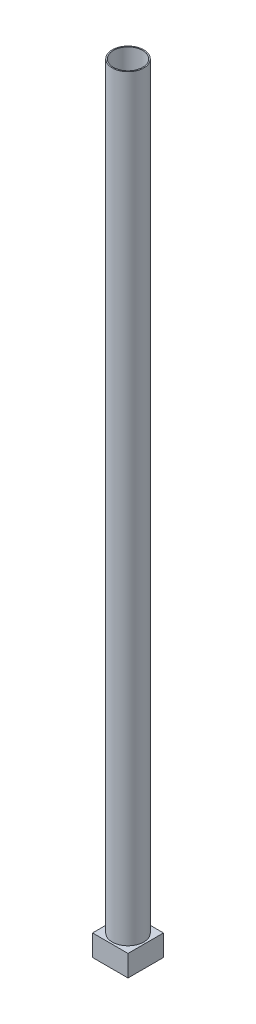
ISO-10303-21;
HEADER;
FILE_DESCRIPTION(('STEP AP214'),'2;1');
FILE_NAME('part.step','',(''),(''),'','','');
FILE_SCHEMA(('AUTOMOTIVE_DESIGN { 1 0 10303 214 1 1 1 1 }'));
ENDSEC;
DATA;
#1=APPLICATION_CONTEXT('core data for automotive mechanical design processes');
#2=APPLICATION_PROTOCOL_DEFINITION('international standard','automotive_design',2000,#1);
#3=PRODUCT_CONTEXT('',#1,'mechanical');
#4=PRODUCT('Part','Part','',(#3));
#5=PRODUCT_RELATED_PRODUCT_CATEGORY('part','',(#4));
#6=PRODUCT_DEFINITION_FORMATION('','',#4);
#7=PRODUCT_DEFINITION_CONTEXT('part definition',#1,'design');
#8=PRODUCT_DEFINITION('design','',#6,#7);
#9=PRODUCT_DEFINITION_SHAPE('','',#8);
#10=(LENGTH_UNIT() NAMED_UNIT(*) SI_UNIT(.MILLI.,.METRE.));
#11=(NAMED_UNIT(*) PLANE_ANGLE_UNIT() SI_UNIT($,.RADIAN.));
#12=(NAMED_UNIT(*) SI_UNIT($,.STERADIAN.) SOLID_ANGLE_UNIT());
#13=UNCERTAINTY_MEASURE_WITH_UNIT(LENGTH_MEASURE(1.E-05),#10,'distance_accuracy_value','');
#14=(GEOMETRIC_REPRESENTATION_CONTEXT(3) GLOBAL_UNCERTAINTY_ASSIGNED_CONTEXT((#13)) GLOBAL_UNIT_ASSIGNED_CONTEXT((#10,
#11,#12)) REPRESENTATION_CONTEXT('',''));
#15=CARTESIAN_POINT('',(0.,0.,0.));
#16=DIRECTION('',(0.,0.,1.));
#17=DIRECTION('',(1.,0.,0.));
#18=AXIS2_PLACEMENT_3D('',#15,#16,#17);
#19=CARTESIAN_POINT('',(50.,30.,-50.));
#20=DIRECTION('',(-1.,0.,0.));
#21=DIRECTION('',(0.,0.,1.));
#22=AXIS2_PLACEMENT_3D('',#19,#20,#21);
#23=PLANE('',#22);
#24=DIRECTION('',(0.,0.,-1.));
#25=VECTOR('',#24,1.);
#26=CARTESIAN_POINT('',(50.,-30.,-50.));
#27=LINE('',#26,#25);
#28=CARTESIAN_POINT('',(50.,-30.,50.));
#29=VERTEX_POINT('',#28);
#30=CARTESIAN_POINT('',(50.,-30.,-50.));
#31=VERTEX_POINT('',#30);
#32=EDGE_CURVE('E114',#29,#31,#27,.T.);
#33=ORIENTED_EDGE('',*,*,#32,.T.);
#34=DIRECTION('',(0.,-1.,0.));
#35=VECTOR('',#34,1.);
#36=CARTESIAN_POINT('',(50.,30.,-50.));
#37=LINE('',#36,#35);
#38=CARTESIAN_POINT('',(50.,30.,-50.));
#39=VERTEX_POINT('',#38);
#40=EDGE_CURVE('E52',#39,#31,#37,.T.);
#41=ORIENTED_EDGE('',*,*,#40,.F.);
#42=DIRECTION('',(0.,0.,-1.));
#43=VECTOR('',#42,1.);
#44=CARTESIAN_POINT('',(50.,30.,-50.));
#45=LINE('',#44,#43);
#46=CARTESIAN_POINT('',(50.,30.,50.));
#47=VERTEX_POINT('',#46);
#48=EDGE_CURVE('E96',#47,#39,#45,.T.);
#49=ORIENTED_EDGE('',*,*,#48,.F.);
#50=DIRECTION('',(0.,-1.,0.));
#51=VECTOR('',#50,1.);
#52=CARTESIAN_POINT('',(50.,30.,50.));
#53=LINE('',#52,#51);
#54=EDGE_CURVE('E110',#47,#29,#53,.T.);
#55=ORIENTED_EDGE('',*,*,#54,.T.);
#56=EDGE_LOOP('',(#33,#41,#49,#55));
#57=FACE_BOUND('',#56,.T.);
#58=ADVANCED_FACE('F43',(#57),#23,.F.);
#59=CARTESIAN_POINT('',(-50.,30.,-50.));
#60=DIRECTION('',(0.,0.,1.));
#61=DIRECTION('',(1.,0.,0.));
#62=AXIS2_PLACEMENT_3D('',#59,#60,#61);
#63=PLANE('',#62);
#64=DIRECTION('',(-1.,0.,0.));
#65=VECTOR('',#64,1.);
#66=CARTESIAN_POINT('',(-50.,-30.,-50.));
#67=LINE('',#66,#65);
#68=CARTESIAN_POINT('',(-50.,-30.,-50.));
#69=VERTEX_POINT('',#68);
#70=EDGE_CURVE('E102',#31,#69,#67,.T.);
#71=ORIENTED_EDGE('',*,*,#70,.T.);
#72=DIRECTION('',(0.,-1.,0.));
#73=VECTOR('',#72,1.);
#74=CARTESIAN_POINT('',(-50.,30.,-50.));
#75=LINE('',#74,#73);
#76=CARTESIAN_POINT('',(-50.,30.,-50.));
#77=VERTEX_POINT('',#76);
#78=EDGE_CURVE('E100',#77,#69,#75,.T.);
#79=ORIENTED_EDGE('',*,*,#78,.F.);
#80=DIRECTION('',(-1.,0.,0.));
#81=VECTOR('',#80,1.);
#82=CARTESIAN_POINT('',(-50.,30.,-50.));
#83=LINE('',#82,#81);
#84=EDGE_CURVE('E91',#39,#77,#83,.T.);
#85=ORIENTED_EDGE('',*,*,#84,.F.);
#86=ORIENTED_EDGE('',*,*,#40,.T.);
#87=EDGE_LOOP('',(#71,#79,#85,#86));
#88=FACE_BOUND('',#87,.T.);
#89=ADVANCED_FACE('F101',(#88),#63,.F.);
#90=CARTESIAN_POINT('',(-50.,30.,-50.));
#91=DIRECTION('',(1.,0.,0.));
#92=DIRECTION('',(0.,0.,-1.));
#93=AXIS2_PLACEMENT_3D('',#90,#91,#92);
#94=PLANE('',#93);
#95=DIRECTION('',(0.,0.,1.));
#96=VECTOR('',#95,1.);
#97=CARTESIAN_POINT('',(-50.,-30.,-50.));
#98=LINE('',#97,#96);
#99=CARTESIAN_POINT('',(-50.,-30.,50.));
#100=VERTEX_POINT('',#99);
#101=EDGE_CURVE('E77',#69,#100,#98,.T.);
#102=ORIENTED_EDGE('',*,*,#101,.T.);
#103=DIRECTION('',(0.,-1.,0.));
#104=VECTOR('',#103,1.);
#105=CARTESIAN_POINT('',(-50.,30.,50.));
#106=LINE('',#105,#104);
#107=CARTESIAN_POINT('',(-50.,30.,50.));
#108=VERTEX_POINT('',#107);
#109=EDGE_CURVE('E104',#108,#100,#106,.T.);
#110=ORIENTED_EDGE('',*,*,#109,.F.);
#111=DIRECTION('',(0.,0.,1.));
#112=VECTOR('',#111,1.);
#113=CARTESIAN_POINT('',(-50.,30.,-50.));
#114=LINE('',#113,#112);
#115=EDGE_CURVE('E94',#77,#108,#114,.T.);
#116=ORIENTED_EDGE('',*,*,#115,.F.);
#117=ORIENTED_EDGE('',*,*,#78,.T.);
#118=EDGE_LOOP('',(#102,#110,#116,#117));
#119=FACE_BOUND('',#118,.T.);
#120=ADVANCED_FACE('F106',(#119),#94,.F.);
#121=CARTESIAN_POINT('',(-50.,30.,50.));
#122=DIRECTION('',(0.,0.,-1.));
#123=DIRECTION('',(-1.,0.,0.));
#124=AXIS2_PLACEMENT_3D('',#121,#122,#123);
#125=PLANE('',#124);
#126=DIRECTION('',(1.,0.,0.));
#127=VECTOR('',#126,1.);
#128=CARTESIAN_POINT('',(-50.,-30.,50.));
#129=LINE('',#128,#127);
#130=EDGE_CURVE('E83',#100,#29,#129,.T.);
#131=ORIENTED_EDGE('',*,*,#130,.T.);
#132=ORIENTED_EDGE('',*,*,#54,.F.);
#133=DIRECTION('',(1.,0.,0.));
#134=VECTOR('',#133,1.);
#135=CARTESIAN_POINT('',(-50.,30.,50.));
#136=LINE('',#135,#134);
#137=EDGE_CURVE('E60',#108,#47,#136,.T.);
#138=ORIENTED_EDGE('',*,*,#137,.F.);
#139=ORIENTED_EDGE('',*,*,#109,.T.);
#140=EDGE_LOOP('',(#131,#132,#138,#139));
#141=FACE_BOUND('',#140,.T.);
#142=ADVANCED_FACE('F143',(#141),#125,.F.);
#143=CARTESIAN_POINT('',(0.,30.,0.));
#144=DIRECTION('',(0.,1.,0.));
#145=DIRECTION('',(0.,0.,1.));
#146=AXIS2_PLACEMENT_3D('',#143,#144,#145);
#147=PLANE('',#146);
#148=CARTESIAN_POINT('',(0.,30.,0.));
#149=DIRECTION('',(0.,1.,0.));
#150=DIRECTION('',(0.,0.,1.));
#151=AXIS2_PLACEMENT_3D('',#148,#149,#150);
#152=CIRCLE('',#151,44.45);
#153=CARTESIAN_POINT('',(0.,30.,44.45));
#154=VERTEX_POINT('',#153);
#155=EDGE_CURVE('E247',#154,#154,#152,.T.);
#156=ORIENTED_EDGE('',*,*,#155,.F.);
#157=EDGE_LOOP('',(#156));
#158=FACE_BOUND('',#157,.T.);
#159=ORIENTED_EDGE('',*,*,#48,.T.);
#160=ORIENTED_EDGE('',*,*,#84,.T.);
#161=ORIENTED_EDGE('',*,*,#115,.T.);
#162=ORIENTED_EDGE('',*,*,#137,.T.);
#163=EDGE_LOOP('',(#159,#160,#161,#162));
#164=FACE_BOUND('',#163,.T.);
#165=ADVANCED_FACE('F92',(#158,#164),#147,.T.);
#166=CARTESIAN_POINT('',(0.,-30.,0.));
#167=DIRECTION('',(0.,1.,0.));
#168=DIRECTION('',(0.,0.,1.));
#169=AXIS2_PLACEMENT_3D('',#166,#167,#168);
#170=PLANE('',#169);
#171=ORIENTED_EDGE('',*,*,#32,.F.);
#172=ORIENTED_EDGE('',*,*,#130,.F.);
#173=ORIENTED_EDGE('',*,*,#101,.F.);
#174=ORIENTED_EDGE('',*,*,#70,.F.);
#175=EDGE_LOOP('',(#171,#172,#173,#174));
#176=FACE_BOUND('',#175,.T.);
#177=ADVANCED_FACE('F132',(#176),#170,.F.);
#178=CARTESIAN_POINT('',(0.,2163.6,0.));
#179=DIRECTION('',(0.,1.,0.));
#180=DIRECTION('',(0.,0.,1.));
#181=AXIS2_PLACEMENT_3D('',#178,#179,#180);
#182=PLANE('',#181);
#183=CARTESIAN_POINT('',(0.,2163.6,0.));
#184=DIRECTION('',(0.,1.,0.));
#185=DIRECTION('',(0.,0.,1.));
#186=AXIS2_PLACEMENT_3D('',#183,#184,#185);
#187=CIRCLE('',#186,44.45);
#188=CARTESIAN_POINT('',(0.,2163.6,44.45));
#189=VERTEX_POINT('',#188);
#190=EDGE_CURVE('E118',#189,#189,#187,.T.);
#191=ORIENTED_EDGE('',*,*,#190,.T.);
#192=EDGE_LOOP('',(#191));
#193=FACE_BOUND('',#192,.T.);
#194=CARTESIAN_POINT('',(0.,2163.6,0.));
#195=DIRECTION('',(0.,1.,0.));
#196=DIRECTION('',(0.,0.,1.));
#197=AXIS2_PLACEMENT_3D('',#194,#195,#196);
#198=CIRCLE('',#197,41.275);
#199=CARTESIAN_POINT('',(0.,2163.6,41.275));
#200=VERTEX_POINT('',#199);
#201=EDGE_CURVE('E244',#200,#200,#198,.T.);
#202=ORIENTED_EDGE('',*,*,#201,.F.);
#203=EDGE_LOOP('',(#202));
#204=FACE_BOUND('',#203,.T.);
#205=ADVANCED_FACE('F134',(#193,#204),#182,.T.);
#206=CARTESIAN_POINT('',(0.,2163.6,0.));
#207=DIRECTION('',(0.,-1.,0.));
#208=DIRECTION('',(0.,0.,-1.));
#209=AXIS2_PLACEMENT_3D('',#206,#207,#208);
#210=CYLINDRICAL_SURFACE('',#209,44.45);
#211=ORIENTED_EDGE('',*,*,#190,.F.);
#212=EDGE_LOOP('',(#211));
#213=FACE_BOUND('',#212,.T.);
#214=ORIENTED_EDGE('',*,*,#155,.T.);
#215=EDGE_LOOP('',(#214));
#216=FACE_BOUND('',#215,.T.);
#217=ADVANCED_FACE('F140',(#213,#216),#210,.T.);
#218=CARTESIAN_POINT('',(0.,2163.6,0.));
#219=DIRECTION('',(0.,-1.,0.));
#220=DIRECTION('',(0.,0.,-1.));
#221=AXIS2_PLACEMENT_3D('',#218,#219,#220);
#222=CYLINDRICAL_SURFACE('',#221,41.275);
#223=ORIENTED_EDGE('',*,*,#201,.T.);
#224=EDGE_LOOP('',(#223));
#225=FACE_BOUND('',#224,.T.);
#226=CARTESIAN_POINT('',(0.,29.9999999999998,0.));
#227=DIRECTION('',(0.,1.,0.));
#228=DIRECTION('',(0.,0.,1.));
#229=AXIS2_PLACEMENT_3D('',#226,#227,#228);
#230=CIRCLE('',#229,41.275);
#231=CARTESIAN_POINT('',(0.,29.9999999999998,41.275));
#232=VERTEX_POINT('',#231);
#233=EDGE_CURVE('E11',#232,#232,#230,.F.);
#234=ORIENTED_EDGE('',*,*,#233,.T.);
#235=EDGE_LOOP('',(#234));
#236=FACE_BOUND('',#235,.T.);
#237=ADVANCED_FACE('F185',(#225,#236),#222,.F.);
#238=ORIENTED_EDGE('',*,*,#233,.F.);
#239=EDGE_LOOP('',(#238));
#240=FACE_BOUND('',#239,.T.);
#241=ADVANCED_FACE('F146',(#240),#147,.T.);
#242=CLOSED_SHELL('',(#58,#89,#120,#142,#165,#177,#205,#217,#237,#241));
#243=MANIFOLD_SOLID_BREP('B2',#242);
#244=ADVANCED_BREP_SHAPE_REPRESENTATION('',(#18,#243),#14);
#245=SHAPE_DEFINITION_REPRESENTATION(#9,#244);
ENDSEC;
END-ISO-10303-21;
